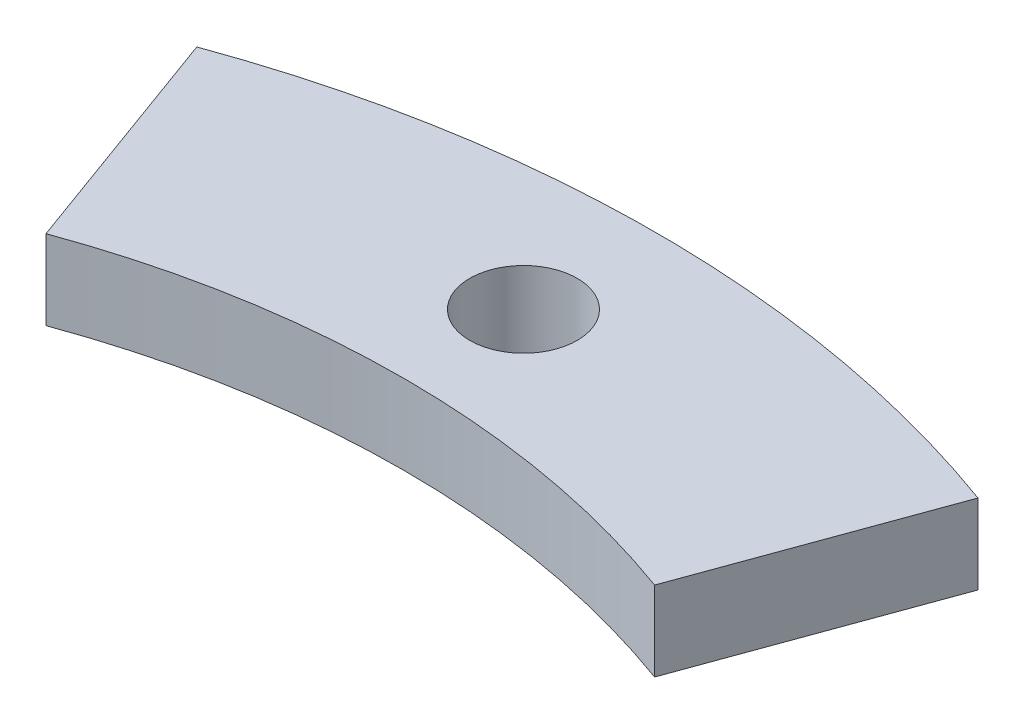
ISO-10303-21;
HEADER;
FILE_DESCRIPTION(('STEP AP214'),'2;1');
FILE_NAME('part.step','',(''),(''),'','','');
FILE_SCHEMA(('AUTOMOTIVE_DESIGN { 1 0 10303 214 1 1 1 1 }'));
ENDSEC;
DATA;
#1=APPLICATION_CONTEXT('core data for automotive mechanical design processes');
#2=APPLICATION_PROTOCOL_DEFINITION('international standard','automotive_design',2000,#1);
#3=PRODUCT_CONTEXT('',#1,'mechanical');
#4=PRODUCT('Part','Part','',(#3));
#5=PRODUCT_RELATED_PRODUCT_CATEGORY('part','',(#4));
#6=PRODUCT_DEFINITION_FORMATION('','',#4);
#7=PRODUCT_DEFINITION_CONTEXT('part definition',#1,'design');
#8=PRODUCT_DEFINITION('design','',#6,#7);
#9=PRODUCT_DEFINITION_SHAPE('','',#8);
#10=(LENGTH_UNIT() NAMED_UNIT(*) SI_UNIT(.MILLI.,.METRE.));
#11=(NAMED_UNIT(*) PLANE_ANGLE_UNIT() SI_UNIT($,.RADIAN.));
#12=(NAMED_UNIT(*) SI_UNIT($,.STERADIAN.) SOLID_ANGLE_UNIT());
#13=UNCERTAINTY_MEASURE_WITH_UNIT(LENGTH_MEASURE(1.E-05),#10,'distance_accuracy_value','');
#14=(GEOMETRIC_REPRESENTATION_CONTEXT(3) GLOBAL_UNCERTAINTY_ASSIGNED_CONTEXT((#13)) GLOBAL_UNIT_ASSIGNED_CONTEXT((#10,
#11,#12)) REPRESENTATION_CONTEXT('',''));
#15=CARTESIAN_POINT('',(0.,0.,0.));
#16=DIRECTION('',(0.,0.,1.));
#17=DIRECTION('',(1.,0.,0.));
#18=AXIS2_PLACEMENT_3D('',#15,#16,#17);
#19=CARTESIAN_POINT('',(0.,3.,0.));
#20=DIRECTION('',(0.,1.,0.));
#21=DIRECTION('',(0.,0.,1.));
#22=AXIS2_PLACEMENT_3D('',#19,#20,#21);
#23=PLANE('',#22);
#24=CARTESIAN_POINT('',(0.,3.,-38.));
#25=DIRECTION('',(0.,1.,0.));
#26=DIRECTION('',(0.,0.,1.));
#27=AXIS2_PLACEMENT_3D('',#24,#25,#26);
#28=CIRCLE('',#27,2.025);
#29=CARTESIAN_POINT('',(0.,3.,-35.975));
#30=VERTEX_POINT('',#29);
#31=EDGE_CURVE('E91',#30,#30,#28,.T.);
#32=ORIENTED_EDGE('',*,*,#31,.F.);
#33=EDGE_LOOP('',(#32));
#34=FACE_BOUND('',#33,.T.);
#35=CARTESIAN_POINT('',(0.,3.,0.));
#36=DIRECTION('',(0.,1.,0.));
#37=DIRECTION('',(0.,0.,1.));
#38=AXIS2_PLACEMENT_3D('',#35,#36,#37);
#39=CIRCLE('',#38,43.);
#40=CARTESIAN_POINT('',(14.7068661630035,3.,-40.4067826937942));
#41=VERTEX_POINT('',#40);
#42=CARTESIAN_POINT('',(-14.7068661630035,3.,-40.4067826937942));
#43=VERTEX_POINT('',#42);
#44=EDGE_CURVE('E95',#41,#43,#39,.T.);
#45=ORIENTED_EDGE('',*,*,#44,.T.);
#46=DIRECTION('',(0.342020143325663,0.,0.939692620785911));
#47=VECTOR('',#46,1.);
#48=CARTESIAN_POINT('',(0.,3.,0.));
#49=LINE('',#48,#47);
#50=CARTESIAN_POINT('',(-11.4576748014097,3.,-31.479702796328));
#51=VERTEX_POINT('',#50);
#52=EDGE_CURVE('E76',#43,#51,#49,.T.);
#53=ORIENTED_EDGE('',*,*,#52,.T.);
#54=CARTESIAN_POINT('',(0.,3.,0.));
#55=DIRECTION('',(0.,1.,0.));
#56=DIRECTION('',(0.,0.,1.));
#57=AXIS2_PLACEMENT_3D('',#54,#55,#56);
#58=CIRCLE('',#57,33.5);
#59=CARTESIAN_POINT('',(11.4576748014097,3.,-31.479702796328));
#60=VERTEX_POINT('',#59);
#61=EDGE_CURVE('E96',#60,#51,#58,.T.);
#62=ORIENTED_EDGE('',*,*,#61,.F.);
#63=DIRECTION('',(-0.342020143325663,0.,0.939692620785911));
#64=VECTOR('',#63,1.);
#65=CARTESIAN_POINT('',(0.,3.,0.));
#66=LINE('',#65,#64);
#67=EDGE_CURVE('E57',#41,#60,#66,.T.);
#68=ORIENTED_EDGE('',*,*,#67,.F.);
#69=EDGE_LOOP('',(#45,#53,#62,#68));
#70=FACE_BOUND('',#69,.T.);
#71=ADVANCED_FACE('F35',(#34,#70),#23,.T.);
#72=CARTESIAN_POINT('',(0.,0.,0.));
#73=DIRECTION('',(0.,1.,0.));
#74=DIRECTION('',(0.,0.,1.));
#75=AXIS2_PLACEMENT_3D('',#72,#73,#74);
#76=PLANE('',#75);
#77=CARTESIAN_POINT('',(0.,0.,-38.));
#78=DIRECTION('',(0.,1.,0.));
#79=DIRECTION('',(0.,0.,1.));
#80=AXIS2_PLACEMENT_3D('',#77,#78,#79);
#81=CIRCLE('',#80,2.025);
#82=CARTESIAN_POINT('',(0.,0.,-35.975));
#83=VERTEX_POINT('',#82);
#84=EDGE_CURVE('E113',#83,#83,#81,.T.);
#85=ORIENTED_EDGE('',*,*,#84,.T.);
#86=EDGE_LOOP('',(#85));
#87=FACE_BOUND('',#86,.T.);
#88=DIRECTION('',(0.342020143325663,0.,0.939692620785911));
#89=VECTOR('',#88,1.);
#90=CARTESIAN_POINT('',(0.,0.,0.));
#91=LINE('',#90,#89);
#92=CARTESIAN_POINT('',(-14.7068661630035,0.,-40.4067826937941));
#93=VERTEX_POINT('',#92);
#94=CARTESIAN_POINT('',(-11.4576748014097,0.,-31.479702796328));
#95=VERTEX_POINT('',#94);
#96=EDGE_CURVE('E50',#93,#95,#91,.T.);
#97=ORIENTED_EDGE('',*,*,#96,.F.);
#98=CARTESIAN_POINT('',(0.,0.,0.));
#99=DIRECTION('',(0.,1.,0.));
#100=DIRECTION('',(0.,0.,1.));
#101=AXIS2_PLACEMENT_3D('',#98,#99,#100);
#102=CIRCLE('',#101,43.);
#103=CARTESIAN_POINT('',(14.7068661630035,0.,-40.4067826937941));
#104=VERTEX_POINT('',#103);
#105=EDGE_CURVE('E88',#104,#93,#102,.T.);
#106=ORIENTED_EDGE('',*,*,#105,.F.);
#107=DIRECTION('',(-0.342020143325663,0.,0.939692620785911));
#108=VECTOR('',#107,1.);
#109=CARTESIAN_POINT('',(0.,0.,0.));
#110=LINE('',#109,#108);
#111=CARTESIAN_POINT('',(11.4576748014097,0.,-31.479702796328));
#112=VERTEX_POINT('',#111);
#113=EDGE_CURVE('E81',#104,#112,#110,.T.);
#114=ORIENTED_EDGE('',*,*,#113,.T.);
#115=CARTESIAN_POINT('',(0.,0.,0.));
#116=DIRECTION('',(0.,1.,0.));
#117=DIRECTION('',(0.,0.,1.));
#118=AXIS2_PLACEMENT_3D('',#115,#116,#117);
#119=CIRCLE('',#118,33.5);
#120=EDGE_CURVE('E90',#112,#95,#119,.T.);
#121=ORIENTED_EDGE('',*,*,#120,.T.);
#122=EDGE_LOOP('',(#97,#106,#114,#121));
#123=FACE_BOUND('',#122,.T.);
#124=ADVANCED_FACE('F86',(#87,#123),#76,.F.);
#125=CARTESIAN_POINT('',(0.,3.,0.));
#126=DIRECTION('',(0.,-1.,0.));
#127=DIRECTION('',(0.,0.,-1.));
#128=AXIS2_PLACEMENT_3D('',#125,#126,#127);
#129=CYLINDRICAL_SURFACE('',#128,43.);
#130=DIRECTION('',(0.,-1.,0.));
#131=VECTOR('',#130,1.);
#132=CARTESIAN_POINT('',(-14.7068661630035,3.,-40.4067826937941));
#133=LINE('',#132,#131);
#134=EDGE_CURVE('E73',#43,#93,#133,.T.);
#135=ORIENTED_EDGE('',*,*,#134,.F.);
#136=ORIENTED_EDGE('',*,*,#44,.F.);
#137=DIRECTION('',(0.,-1.,0.));
#138=VECTOR('',#137,1.);
#139=CARTESIAN_POINT('',(14.7068661630035,3.,-40.4067826937941));
#140=LINE('',#139,#138);
#141=EDGE_CURVE('E94',#41,#104,#140,.T.);
#142=ORIENTED_EDGE('',*,*,#141,.T.);
#143=ORIENTED_EDGE('',*,*,#105,.T.);
#144=EDGE_LOOP('',(#135,#136,#142,#143));
#145=FACE_BOUND('',#144,.T.);
#146=ADVANCED_FACE('F37',(#145),#129,.T.);
#147=CARTESIAN_POINT('',(0.,3.,0.));
#148=DIRECTION('',(0.,-1.,0.));
#149=DIRECTION('',(0.,0.,-1.));
#150=AXIS2_PLACEMENT_3D('',#147,#148,#149);
#151=CYLINDRICAL_SURFACE('',#150,33.5);
#152=ORIENTED_EDGE('',*,*,#61,.T.);
#153=DIRECTION('',(0.,-1.,0.));
#154=VECTOR('',#153,1.);
#155=CARTESIAN_POINT('',(-11.4576748014097,3.,-31.479702796328));
#156=LINE('',#155,#154);
#157=EDGE_CURVE('E11',#51,#95,#156,.T.);
#158=ORIENTED_EDGE('',*,*,#157,.T.);
#159=ORIENTED_EDGE('',*,*,#120,.F.);
#160=DIRECTION('',(0.,-1.,0.));
#161=VECTOR('',#160,1.);
#162=CARTESIAN_POINT('',(11.4576748014097,3.,-31.479702796328));
#163=LINE('',#162,#161);
#164=EDGE_CURVE('E43',#60,#112,#163,.T.);
#165=ORIENTED_EDGE('',*,*,#164,.F.);
#166=EDGE_LOOP('',(#152,#158,#159,#165));
#167=FACE_BOUND('',#166,.T.);
#168=ADVANCED_FACE('F106',(#167),#151,.F.);
#169=CARTESIAN_POINT('',(0.,0.,0.));
#170=DIRECTION('',(-0.939692620785911,0.,-0.342020143325663));
#171=DIRECTION('',(-0.342020143325663,0.,0.939692620785911));
#172=AXIS2_PLACEMENT_3D('',#169,#170,#171);
#173=PLANE('',#172);
#174=ORIENTED_EDGE('',*,*,#67,.T.);
#175=ORIENTED_EDGE('',*,*,#164,.T.);
#176=ORIENTED_EDGE('',*,*,#113,.F.);
#177=ORIENTED_EDGE('',*,*,#141,.F.);
#178=EDGE_LOOP('',(#174,#175,#176,#177));
#179=FACE_BOUND('',#178,.T.);
#180=ADVANCED_FACE('F102',(#179),#173,.F.);
#181=CARTESIAN_POINT('',(0.,0.,0.));
#182=DIRECTION('',(-0.939692620785911,0.,0.342020143325663));
#183=DIRECTION('',(0.342020143325663,0.,0.939692620785911));
#184=AXIS2_PLACEMENT_3D('',#181,#182,#183);
#185=PLANE('',#184);
#186=ORIENTED_EDGE('',*,*,#134,.T.);
#187=ORIENTED_EDGE('',*,*,#96,.T.);
#188=ORIENTED_EDGE('',*,*,#157,.F.);
#189=ORIENTED_EDGE('',*,*,#52,.F.);
#190=EDGE_LOOP('',(#186,#187,#188,#189));
#191=FACE_BOUND('',#190,.T.);
#192=ADVANCED_FACE('F74',(#191),#185,.T.);
#193=CARTESIAN_POINT('',(0.,0.,-38.));
#194=DIRECTION('',(0.,1.,0.));
#195=DIRECTION('',(0.,0.,1.));
#196=AXIS2_PLACEMENT_3D('',#193,#194,#195);
#197=CYLINDRICAL_SURFACE('',#196,2.025);
#198=ORIENTED_EDGE('',*,*,#31,.T.);
#199=EDGE_LOOP('',(#198));
#200=FACE_BOUND('',#199,.T.);
#201=ORIENTED_EDGE('',*,*,#84,.F.);
#202=EDGE_LOOP('',(#201));
#203=FACE_BOUND('',#202,.T.);
#204=ADVANCED_FACE('F118',(#200,#203),#197,.F.);
#205=CLOSED_SHELL('',(#71,#124,#146,#168,#180,#192,#204));
#206=MANIFOLD_SOLID_BREP('B2',#205);
#207=ADVANCED_BREP_SHAPE_REPRESENTATION('',(#18,#206),#14);
#208=SHAPE_DEFINITION_REPRESENTATION(#9,#207);
ENDSEC;
END-ISO-10303-21;
